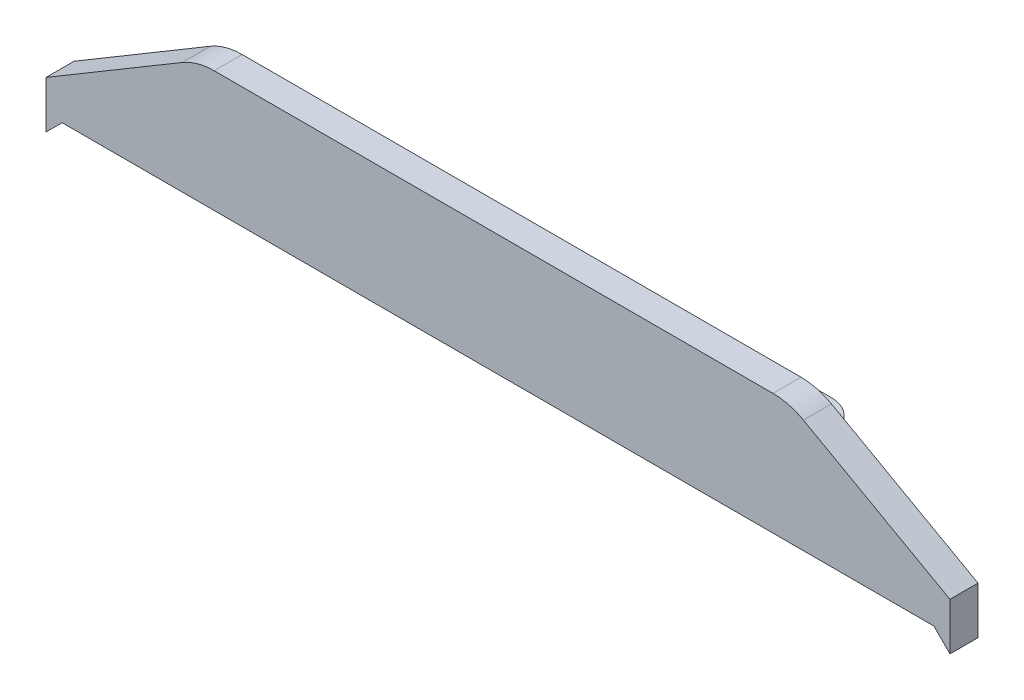
ISO-10303-21;
HEADER;
FILE_DESCRIPTION(('STEP AP214'),'2;1');
FILE_NAME('part.step','',(''),(''),'','','');
FILE_SCHEMA(('AUTOMOTIVE_DESIGN { 1 0 10303 214 1 1 1 1 }'));
ENDSEC;
DATA;
#1=APPLICATION_CONTEXT('core data for automotive mechanical design processes');
#2=APPLICATION_PROTOCOL_DEFINITION('international standard','automotive_design',2000,#1);
#3=PRODUCT_CONTEXT('',#1,'mechanical');
#4=PRODUCT('Part','Part','',(#3));
#5=PRODUCT_RELATED_PRODUCT_CATEGORY('part','',(#4));
#6=PRODUCT_DEFINITION_FORMATION('','',#4);
#7=PRODUCT_DEFINITION_CONTEXT('part definition',#1,'design');
#8=PRODUCT_DEFINITION('design','',#6,#7);
#9=PRODUCT_DEFINITION_SHAPE('','',#8);
#10=(LENGTH_UNIT() NAMED_UNIT(*) SI_UNIT(.MILLI.,.METRE.));
#11=(NAMED_UNIT(*) PLANE_ANGLE_UNIT() SI_UNIT($,.RADIAN.));
#12=(NAMED_UNIT(*) SI_UNIT($,.STERADIAN.) SOLID_ANGLE_UNIT());
#13=UNCERTAINTY_MEASURE_WITH_UNIT(LENGTH_MEASURE(1.E-05),#10,'distance_accuracy_value','');
#14=(GEOMETRIC_REPRESENTATION_CONTEXT(3) GLOBAL_UNCERTAINTY_ASSIGNED_CONTEXT((#13)) GLOBAL_UNIT_ASSIGNED_CONTEXT((#10,
#11,#12)) REPRESENTATION_CONTEXT('',''));
#15=CARTESIAN_POINT('',(0.,0.,0.));
#16=DIRECTION('',(0.,0.,1.));
#17=DIRECTION('',(1.,0.,0.));
#18=AXIS2_PLACEMENT_3D('',#15,#16,#17);
#19=CARTESIAN_POINT('',(0.,0.,0.));
#20=DIRECTION('',(0.,0.,1.));
#21=DIRECTION('',(1.,0.,0.));
#22=AXIS2_PLACEMENT_3D('',#19,#20,#21);
#23=PLANE('',#22);
#24=DIRECTION('',(-0.859315051902421,-0.511446616543643,0.));
#25=VECTOR('',#24,1.);
#26=CARTESIAN_POINT('',(22.3262838126983,-37.5118558080438,0.));
#27=LINE('',#26,#25);
#28=CARTESIAN_POINT('',(21.8545267075118,-37.7926359186027,0.));
#29=VERTEX_POINT('',#28);
#30=CARTESIAN_POINT('',(0.,-50.8,0.));
#31=VERTEX_POINT('',#30);
#32=EDGE_CURVE('E224',#29,#31,#27,.T.);
#33=ORIENTED_EDGE('',*,*,#32,.F.);
#34=CARTESIAN_POINT('',(26.9689928729482,-46.3857864376269,0.));
#35=DIRECTION('',(0.,0.,1.));
#36=DIRECTION('',(1.,0.,0.));
#37=AXIS2_PLACEMENT_3D('',#34,#35,#36);
#38=CIRCLE('',#37,10.);
#39=CARTESIAN_POINT('',(26.9689928729482,-36.3857864376269,0.));
#40=VERTEX_POINT('',#39);
#41=EDGE_CURVE('E259',#29,#40,#38,.F.);
#42=ORIENTED_EDGE('',*,*,#41,.T.);
#43=DIRECTION('',(-1.,0.,0.));
#44=VECTOR('',#43,1.);
#45=CARTESIAN_POINT('',(0.,-36.3857864376269,0.));
#46=LINE('',#45,#44);
#47=CARTESIAN_POINT('',(116.612627303235,-36.3857864376269,0.));
#48=VERTEX_POINT('',#47);
#49=EDGE_CURVE('E199',#48,#40,#46,.T.);
#50=ORIENTED_EDGE('',*,*,#49,.F.);
#51=CARTESIAN_POINT('',(116.612627303235,-46.3857864376269,0.));
#52=DIRECTION('',(0.,0.,1.));
#53=DIRECTION('',(1.,0.,0.));
#54=AXIS2_PLACEMENT_3D('',#51,#52,#53);
#55=CIRCLE('',#54,10.);
#56=CARTESIAN_POINT('',(121.492588511603,-37.6573284635727,0.));
#57=VERTEX_POINT('',#56);
#58=EDGE_CURVE('E257',#48,#57,#55,.F.);
#59=ORIENTED_EDGE('',*,*,#58,.T.);
#60=DIRECTION('',(-0.872845797405426,0.48799612083672,0.));
#61=VECTOR('',#60,1.);
#62=CARTESIAN_POINT('',(12.8923065712925,23.0596005360055,0.));
#63=LINE('',#62,#61);
#64=CARTESIAN_POINT('',(145.,-50.8,0.));
#65=VERTEX_POINT('',#64);
#66=EDGE_CURVE('E207',#65,#57,#63,.T.);
#67=ORIENTED_EDGE('',*,*,#66,.F.);
#68=DIRECTION('',(0.,1.,0.));
#69=VECTOR('',#68,1.);
#70=CARTESIAN_POINT('',(145.,0.,0.));
#71=LINE('',#70,#69);
#72=CARTESIAN_POINT('',(145.,-58.3857864376269,0.));
#73=VERTEX_POINT('',#72);
#74=EDGE_CURVE('E235',#73,#65,#71,.T.);
#75=ORIENTED_EDGE('',*,*,#74,.F.);
#76=DIRECTION('',(0.707106781186544,-0.707106781186551,0.));
#77=VECTOR('',#76,1.);
#78=CARTESIAN_POINT('',(43.3071067811873,43.3071067811868,0.));
#79=LINE('',#78,#77);
#80=CARTESIAN_POINT('',(142.414213562373,-55.8,0.));
#81=VERTEX_POINT('',#80);
#82=EDGE_CURVE('E233',#81,#73,#79,.T.);
#83=ORIENTED_EDGE('',*,*,#82,.F.);
#84=DIRECTION('',(1.,0.,0.));
#85=VECTOR('',#84,1.);
#86=CARTESIAN_POINT('',(0.,-55.8,0.));
#87=LINE('',#86,#85);
#88=CARTESIAN_POINT('',(2.58578643762691,-55.8,0.));
#89=VERTEX_POINT('',#88);
#90=EDGE_CURVE('E231',#89,#81,#87,.T.);
#91=ORIENTED_EDGE('',*,*,#90,.F.);
#92=DIRECTION('',(0.707106781186553,0.707106781186542,0.));
#93=VECTOR('',#92,1.);
#94=CARTESIAN_POINT('',(29.1928932188134,-29.1928932188139,0.));
#95=LINE('',#94,#93);
#96=CARTESIAN_POINT('',(0.,-58.3857864376269,0.));
#97=VERTEX_POINT('',#96);
#98=EDGE_CURVE('E229',#97,#89,#95,.T.);
#99=ORIENTED_EDGE('',*,*,#98,.F.);
#100=DIRECTION('',(0.,1.,0.));
#101=VECTOR('',#100,1.);
#102=CARTESIAN_POINT('',(0.,0.,0.));
#103=LINE('',#102,#101);
#104=EDGE_CURVE('E226',#97,#31,#103,.T.);
#105=ORIENTED_EDGE('',*,*,#104,.T.);
#106=EDGE_LOOP('',(#33,#42,#50,#59,#67,#75,#83,#91,#99,#105));
#107=FACE_BOUND('',#106,.T.);
#108=DIRECTION('',(1.,0.,0.));
#109=VECTOR('',#108,1.);
#110=CARTESIAN_POINT('',(21.4945597627013,-53.8,0.));
#111=LINE('',#110,#109);
#112=CARTESIAN_POINT('',(21.4945597627013,-53.8,0.));
#113=VERTEX_POINT('',#112);
#114=CARTESIAN_POINT('',(123.505440237299,-53.8,0.));
#115=VERTEX_POINT('',#114);
#116=EDGE_CURVE('E165',#113,#115,#111,.T.);
#117=ORIENTED_EDGE('',*,*,#116,.T.);
#118=DIRECTION('',(0.,-1.,0.));
#119=VECTOR('',#118,1.);
#120=CARTESIAN_POINT('',(123.505440237299,52.1677521857994,0.));
#121=LINE('',#120,#119);
#122=CARTESIAN_POINT('',(123.505440237299,-50.8,0.));
#123=VERTEX_POINT('',#122);
#124=EDGE_CURVE('E164',#123,#115,#121,.T.);
#125=ORIENTED_EDGE('',*,*,#124,.F.);
#126=DIRECTION('',(-1.,0.,0.));
#127=VECTOR('',#126,1.);
#128=CARTESIAN_POINT('',(21.4945597627013,-50.8,0.));
#129=LINE('',#128,#127);
#130=CARTESIAN_POINT('',(21.4945597627013,-50.8,0.));
#131=VERTEX_POINT('',#130);
#132=EDGE_CURVE('E161',#123,#131,#129,.T.);
#133=ORIENTED_EDGE('',*,*,#132,.T.);
#134=DIRECTION('',(0.,-1.,0.));
#135=VECTOR('',#134,1.);
#136=CARTESIAN_POINT('',(21.4945597627013,52.1677521857994,0.));
#137=LINE('',#136,#135);
#138=EDGE_CURVE('E600',#131,#113,#137,.T.);
#139=ORIENTED_EDGE('',*,*,#138,.T.);
#140=EDGE_LOOP('',(#117,#125,#133,#139));
#141=FACE_BOUND('',#140,.T.);
#142=ADVANCED_FACE('F39',(#107,#141),#23,.F.);
#143=CARTESIAN_POINT('',(0.,-36.3857864376269,4.5));
#144=DIRECTION('',(0.,-1.,0.));
#145=DIRECTION('',(0.,0.,-1.));
#146=AXIS2_PLACEMENT_3D('',#143,#144,#145);
#147=PLANE('',#146);
#148=ORIENTED_EDGE('',*,*,#49,.T.);
#149=DIRECTION('',(0.,0.,-1.));
#150=VECTOR('',#149,1.);
#151=CARTESIAN_POINT('',(26.9689928729482,-36.3857864376269,4.5));
#152=LINE('',#151,#150);
#153=CARTESIAN_POINT('',(26.9689928729482,-36.3857864376269,4.5));
#154=VERTEX_POINT('',#153);
#155=EDGE_CURVE('E60',#40,#154,#152,.F.);
#156=ORIENTED_EDGE('',*,*,#155,.T.);
#157=DIRECTION('',(-1.,0.,0.));
#158=VECTOR('',#157,1.);
#159=CARTESIAN_POINT('',(0.,-36.3857864376269,4.5));
#160=LINE('',#159,#158);
#161=CARTESIAN_POINT('',(116.612627303235,-36.3857864376269,4.5));
#162=VERTEX_POINT('',#161);
#163=EDGE_CURVE('E204',#162,#154,#160,.T.);
#164=ORIENTED_EDGE('',*,*,#163,.F.);
#165=DIRECTION('',(0.,0.,-1.));
#166=VECTOR('',#165,1.);
#167=CARTESIAN_POINT('',(116.612627303235,-36.3857864376269,4.5));
#168=LINE('',#167,#166);
#169=EDGE_CURVE('E261',#162,#48,#168,.T.);
#170=ORIENTED_EDGE('',*,*,#169,.T.);
#171=EDGE_LOOP('',(#148,#156,#164,#170));
#172=FACE_BOUND('',#171,.T.);
#173=ADVANCED_FACE('F281',(#172),#147,.F.);
#174=CARTESIAN_POINT('',(22.3262838126983,-37.5118558080438,4.5));
#175=DIRECTION('',(0.511446616543643,-0.859315051902421,0.));
#176=DIRECTION('',(0.859315051902421,0.511446616543643,0.));
#177=AXIS2_PLACEMENT_3D('',#174,#175,#176);
#178=PLANE('',#177);
#179=DIRECTION('',(-0.859315051902421,-0.511446616543643,0.));
#180=VECTOR('',#179,1.);
#181=CARTESIAN_POINT('',(22.3262838126983,-37.5118558080438,4.5));
#182=LINE('',#181,#180);
#183=CARTESIAN_POINT('',(21.8545267075118,-37.7926359186027,4.5));
#184=VERTEX_POINT('',#183);
#185=CARTESIAN_POINT('',(0.,-50.8,4.5));
#186=VERTEX_POINT('',#185);
#187=EDGE_CURVE('E206',#184,#186,#182,.T.);
#188=ORIENTED_EDGE('',*,*,#187,.F.);
#189=DIRECTION('',(0.,0.,-1.));
#190=VECTOR('',#189,1.);
#191=CARTESIAN_POINT('',(21.8545267075118,-37.7926359186027,4.5));
#192=LINE('',#191,#190);
#193=EDGE_CURVE('E254',#184,#29,#192,.T.);
#194=ORIENTED_EDGE('',*,*,#193,.T.);
#195=ORIENTED_EDGE('',*,*,#32,.T.);
#196=DIRECTION('',(0.,0.,-1.));
#197=VECTOR('',#196,1.);
#198=CARTESIAN_POINT('',(0.,-50.8,4.5));
#199=LINE('',#198,#197);
#200=EDGE_CURVE('E251',#186,#31,#199,.T.);
#201=ORIENTED_EDGE('',*,*,#200,.F.);
#202=EDGE_LOOP('',(#188,#194,#195,#201));
#203=FACE_BOUND('',#202,.T.);
#204=ADVANCED_FACE('F275',(#203),#178,.F.);
#205=CARTESIAN_POINT('',(0.,0.,4.5));
#206=DIRECTION('',(-1.,0.,0.));
#207=DIRECTION('',(0.,0.,1.));
#208=AXIS2_PLACEMENT_3D('',#205,#206,#207);
#209=PLANE('',#208);
#210=ORIENTED_EDGE('',*,*,#104,.F.);
#211=DIRECTION('',(0.,0.,-1.));
#212=VECTOR('',#211,1.);
#213=CARTESIAN_POINT('',(0.,-58.3857864376269,4.5));
#214=LINE('',#213,#212);
#215=CARTESIAN_POINT('',(0.,-58.3857864376269,4.5));
#216=VERTEX_POINT('',#215);
#217=EDGE_CURVE('E249',#216,#97,#214,.T.);
#218=ORIENTED_EDGE('',*,*,#217,.F.);
#219=DIRECTION('',(0.,1.,0.));
#220=VECTOR('',#219,1.);
#221=CARTESIAN_POINT('',(0.,0.,4.5));
#222=LINE('',#221,#220);
#223=EDGE_CURVE('E209',#216,#186,#222,.T.);
#224=ORIENTED_EDGE('',*,*,#223,.T.);
#225=ORIENTED_EDGE('',*,*,#200,.T.);
#226=EDGE_LOOP('',(#210,#218,#224,#225));
#227=FACE_BOUND('',#226,.T.);
#228=ADVANCED_FACE('F309',(#227),#209,.T.);
#229=CARTESIAN_POINT('',(29.1928932188134,-29.1928932188139,4.5));
#230=DIRECTION('',(-0.707106781186542,0.707106781186553,0.));
#231=DIRECTION('',(-0.707106781186553,-0.707106781186542,0.));
#232=AXIS2_PLACEMENT_3D('',#229,#230,#231);
#233=PLANE('',#232);
#234=ORIENTED_EDGE('',*,*,#98,.T.);
#235=DIRECTION('',(0.,0.,-1.));
#236=VECTOR('',#235,1.);
#237=CARTESIAN_POINT('',(2.58578643762691,-55.8,4.5));
#238=LINE('',#237,#236);
#239=CARTESIAN_POINT('',(2.58578643762691,-55.8,4.5));
#240=VERTEX_POINT('',#239);
#241=EDGE_CURVE('E246',#240,#89,#238,.T.);
#242=ORIENTED_EDGE('',*,*,#241,.F.);
#243=DIRECTION('',(0.707106781186553,0.707106781186542,0.));
#244=VECTOR('',#243,1.);
#245=CARTESIAN_POINT('',(29.1928932188134,-29.1928932188139,4.5));
#246=LINE('',#245,#244);
#247=EDGE_CURVE('E212',#216,#240,#246,.T.);
#248=ORIENTED_EDGE('',*,*,#247,.F.);
#249=ORIENTED_EDGE('',*,*,#217,.T.);
#250=EDGE_LOOP('',(#234,#242,#248,#249));
#251=FACE_BOUND('',#250,.T.);
#252=ADVANCED_FACE('F306',(#251),#233,.F.);
#253=CARTESIAN_POINT('',(0.,-55.8,4.5));
#254=DIRECTION('',(0.,1.,0.));
#255=DIRECTION('',(0.,0.,1.));
#256=AXIS2_PLACEMENT_3D('',#253,#254,#255);
#257=PLANE('',#256);
#258=ORIENTED_EDGE('',*,*,#90,.T.);
#259=DIRECTION('',(0.,0.,-1.));
#260=VECTOR('',#259,1.);
#261=CARTESIAN_POINT('',(142.414213562373,-55.8,4.5));
#262=LINE('',#261,#260);
#263=CARTESIAN_POINT('',(142.414213562373,-55.8,4.5));
#264=VERTEX_POINT('',#263);
#265=EDGE_CURVE('E243',#264,#81,#262,.T.);
#266=ORIENTED_EDGE('',*,*,#265,.F.);
#267=DIRECTION('',(1.,0.,0.));
#268=VECTOR('',#267,1.);
#269=CARTESIAN_POINT('',(0.,-55.8,4.5));
#270=LINE('',#269,#268);
#271=EDGE_CURVE('E214',#240,#264,#270,.T.);
#272=ORIENTED_EDGE('',*,*,#271,.F.);
#273=ORIENTED_EDGE('',*,*,#241,.T.);
#274=EDGE_LOOP('',(#258,#266,#272,#273));
#275=FACE_BOUND('',#274,.T.);
#276=ADVANCED_FACE('F302',(#275),#257,.F.);
#277=CARTESIAN_POINT('',(43.3071067811873,43.3071067811868,4.5));
#278=DIRECTION('',(0.707106781186551,0.707106781186544,0.));
#279=DIRECTION('',(-0.707106781186544,0.707106781186551,0.));
#280=AXIS2_PLACEMENT_3D('',#277,#278,#279);
#281=PLANE('',#280);
#282=ORIENTED_EDGE('',*,*,#82,.T.);
#283=DIRECTION('',(0.,0.,-1.));
#284=VECTOR('',#283,1.);
#285=CARTESIAN_POINT('',(145.,-58.3857864376269,4.5));
#286=LINE('',#285,#284);
#287=CARTESIAN_POINT('',(145.,-58.3857864376269,4.5));
#288=VERTEX_POINT('',#287);
#289=EDGE_CURVE('E240',#288,#73,#286,.T.);
#290=ORIENTED_EDGE('',*,*,#289,.F.);
#291=DIRECTION('',(0.707106781186544,-0.707106781186551,0.));
#292=VECTOR('',#291,1.);
#293=CARTESIAN_POINT('',(43.3071067811873,43.3071067811868,4.5));
#294=LINE('',#293,#292);
#295=EDGE_CURVE('E216',#264,#288,#294,.T.);
#296=ORIENTED_EDGE('',*,*,#295,.F.);
#297=ORIENTED_EDGE('',*,*,#265,.T.);
#298=EDGE_LOOP('',(#282,#290,#296,#297));
#299=FACE_BOUND('',#298,.T.);
#300=ADVANCED_FACE('F297',(#299),#281,.F.);
#301=CARTESIAN_POINT('',(145.,0.,4.5));
#302=DIRECTION('',(-1.,0.,0.));
#303=DIRECTION('',(0.,0.,1.));
#304=AXIS2_PLACEMENT_3D('',#301,#302,#303);
#305=PLANE('',#304);
#306=ORIENTED_EDGE('',*,*,#74,.T.);
#307=DIRECTION('',(0.,0.,-1.));
#308=VECTOR('',#307,1.);
#309=CARTESIAN_POINT('',(145.,-50.8,4.5));
#310=LINE('',#309,#308);
#311=CARTESIAN_POINT('',(145.,-50.8,4.5));
#312=VERTEX_POINT('',#311);
#313=EDGE_CURVE('E222',#312,#65,#310,.T.);
#314=ORIENTED_EDGE('',*,*,#313,.F.);
#315=DIRECTION('',(0.,1.,0.));
#316=VECTOR('',#315,1.);
#317=CARTESIAN_POINT('',(145.,0.,4.5));
#318=LINE('',#317,#316);
#319=EDGE_CURVE('E218',#288,#312,#318,.T.);
#320=ORIENTED_EDGE('',*,*,#319,.F.);
#321=ORIENTED_EDGE('',*,*,#289,.T.);
#322=EDGE_LOOP('',(#306,#314,#320,#321));
#323=FACE_BOUND('',#322,.T.);
#324=ADVANCED_FACE('F291',(#323),#305,.F.);
#325=CARTESIAN_POINT('',(12.8923065712925,23.0596005360055,4.5));
#326=DIRECTION('',(-0.48799612083672,-0.872845797405425,0.));
#327=DIRECTION('',(0.872845797405426,-0.48799612083672,0.));
#328=AXIS2_PLACEMENT_3D('',#325,#326,#327);
#329=PLANE('',#328);
#330=ORIENTED_EDGE('',*,*,#66,.T.);
#331=DIRECTION('',(0.,0.,-1.));
#332=VECTOR('',#331,1.);
#333=CARTESIAN_POINT('',(121.492588511603,-37.6573284635727,4.5));
#334=LINE('',#333,#332);
#335=CARTESIAN_POINT('',(121.492588511603,-37.6573284635727,4.5));
#336=VERTEX_POINT('',#335);
#337=EDGE_CURVE('E11',#57,#336,#334,.F.);
#338=ORIENTED_EDGE('',*,*,#337,.T.);
#339=DIRECTION('',(-0.872845797405426,0.48799612083672,0.));
#340=VECTOR('',#339,1.);
#341=CARTESIAN_POINT('',(12.8923065712925,23.0596005360055,4.5));
#342=LINE('',#341,#340);
#343=EDGE_CURVE('E220',#312,#336,#342,.T.);
#344=ORIENTED_EDGE('',*,*,#343,.F.);
#345=ORIENTED_EDGE('',*,*,#313,.T.);
#346=EDGE_LOOP('',(#330,#338,#344,#345));
#347=FACE_BOUND('',#346,.T.);
#348=ADVANCED_FACE('F287',(#347),#329,.F.);
#349=CARTESIAN_POINT('',(0.,0.,4.5));
#350=DIRECTION('',(0.,0.,1.));
#351=DIRECTION('',(1.,0.,0.));
#352=AXIS2_PLACEMENT_3D('',#349,#350,#351);
#353=PLANE('',#352);
#354=ORIENTED_EDGE('',*,*,#163,.T.);
#355=CARTESIAN_POINT('',(26.9689928729482,-46.3857864376269,4.5));
#356=DIRECTION('',(0.,0.,1.));
#357=DIRECTION('',(1.,0.,0.));
#358=AXIS2_PLACEMENT_3D('',#355,#356,#357);
#359=CIRCLE('',#358,10.);
#360=EDGE_CURVE('E47',#154,#184,#359,.T.);
#361=ORIENTED_EDGE('',*,*,#360,.T.);
#362=ORIENTED_EDGE('',*,*,#187,.T.);
#363=ORIENTED_EDGE('',*,*,#223,.F.);
#364=ORIENTED_EDGE('',*,*,#247,.T.);
#365=ORIENTED_EDGE('',*,*,#271,.T.);
#366=ORIENTED_EDGE('',*,*,#295,.T.);
#367=ORIENTED_EDGE('',*,*,#319,.T.);
#368=ORIENTED_EDGE('',*,*,#343,.T.);
#369=CARTESIAN_POINT('',(116.612627303235,-46.3857864376269,4.5));
#370=DIRECTION('',(0.,0.,1.));
#371=DIRECTION('',(1.,0.,0.));
#372=AXIS2_PLACEMENT_3D('',#369,#370,#371);
#373=CIRCLE('',#372,10.);
#374=EDGE_CURVE('E265',#336,#162,#373,.T.);
#375=ORIENTED_EDGE('',*,*,#374,.T.);
#376=EDGE_LOOP('',(#354,#361,#362,#363,#364,#365,#366,#367,#368,#375));
#377=FACE_BOUND('',#376,.T.);
#378=ADVANCED_FACE('F269',(#377),#353,.T.);
#379=CARTESIAN_POINT('',(107.512278329995,-53.8,-9.20493680791258));
#380=DIRECTION('',(0.,1.,0.));
#381=DIRECTION('',(0.,0.,1.));
#382=AXIS2_PLACEMENT_3D('',#379,#380,#381);
#383=PLANE('',#382);
#384=ORIENTED_EDGE('',*,*,#116,.F.);
#385=DIRECTION('',(-0.707106781186548,0.,0.707106781186547));
#386=VECTOR('',#385,1.);
#387=CARTESIAN_POINT('',(34.0936091203093,-53.8,-12.599049357608));
#388=LINE('',#387,#386);
#389=CARTESIAN_POINT('',(34.0936091203093,-53.8,-12.599049357608));
#390=VERTEX_POINT('',#389);
#391=EDGE_CURVE('E203',#390,#113,#388,.T.);
#392=ORIENTED_EDGE('',*,*,#391,.F.);
#393=CARTESIAN_POINT('',(37.4877216700047,-53.8,-9.20493680791258));
#394=DIRECTION('',(0.,1.,0.));
#395=DIRECTION('',(0.,0.,1.));
#396=AXIS2_PLACEMENT_3D('',#393,#394,#395);
#397=CIRCLE('',#396,4.79999999999999);
#398=CARTESIAN_POINT('',(37.4877216700048,-53.8,-14.0049368079126));
#399=VERTEX_POINT('',#398);
#400=EDGE_CURVE('E195',#399,#390,#397,.T.);
#401=ORIENTED_EDGE('',*,*,#400,.F.);
#402=DIRECTION('',(-1.,0.,0.));
#403=VECTOR('',#402,1.);
#404=CARTESIAN_POINT('',(107.512278329995,-53.8,-14.0049368079126));
#405=LINE('',#404,#403);
#406=CARTESIAN_POINT('',(107.512278329995,-53.8,-14.0049368079126));
#407=VERTEX_POINT('',#406);
#408=EDGE_CURVE('E190',#407,#399,#405,.T.);
#409=ORIENTED_EDGE('',*,*,#408,.F.);
#410=CARTESIAN_POINT('',(107.512278329995,-53.8,-9.20493680791258));
#411=DIRECTION('',(0.,1.,0.));
#412=DIRECTION('',(0.,0.,1.));
#413=AXIS2_PLACEMENT_3D('',#410,#411,#412);
#414=CIRCLE('',#413,4.79999999999998);
#415=CARTESIAN_POINT('',(110.906390879691,-53.8,-12.599049357608));
#416=VERTEX_POINT('',#415);
#417=EDGE_CURVE('E175',#416,#407,#414,.T.);
#418=ORIENTED_EDGE('',*,*,#417,.F.);
#419=DIRECTION('',(-0.707106781186547,0.,-0.707106781186548));
#420=VECTOR('',#419,1.);
#421=CARTESIAN_POINT('',(123.505440237299,-53.8,0.));
#422=LINE('',#421,#420);
#423=EDGE_CURVE('E171',#115,#416,#422,.T.);
#424=ORIENTED_EDGE('',*,*,#423,.F.);
#425=EDGE_LOOP('',(#384,#392,#401,#409,#418,#424));
#426=FACE_BOUND('',#425,.T.);
#427=CARTESIAN_POINT('',(37.4877216700047,-53.8,-9.20493680791258));
#428=DIRECTION('',(0.,1.,0.));
#429=DIRECTION('',(0.,0.,1.));
#430=AXIS2_PLACEMENT_3D('',#427,#428,#429);
#431=CIRCLE('',#430,1.65);
#432=CARTESIAN_POINT('',(37.4877216700047,-53.8,-7.55493680791258));
#433=VERTEX_POINT('',#432);
#434=EDGE_CURVE('E588',#433,#433,#431,.T.);
#435=ORIENTED_EDGE('',*,*,#434,.T.);
#436=EDGE_LOOP('',(#435));
#437=FACE_BOUND('',#436,.T.);
#438=CARTESIAN_POINT('',(107.512278329995,-53.8,-9.20493680791258));
#439=DIRECTION('',(0.,1.,0.));
#440=DIRECTION('',(0.,0.,1.));
#441=AXIS2_PLACEMENT_3D('',#438,#439,#440);
#442=CIRCLE('',#441,1.65);
#443=CARTESIAN_POINT('',(107.512278329995,-53.8,-7.55493680791258));
#444=VERTEX_POINT('',#443);
#445=EDGE_CURVE('E590',#444,#444,#442,.T.);
#446=ORIENTED_EDGE('',*,*,#445,.T.);
#447=EDGE_LOOP('',(#446));
#448=FACE_BOUND('',#447,.T.);
#449=ADVANCED_FACE('F358',(#426,#437,#448),#383,.F.);
#450=CARTESIAN_POINT('',(123.505440237299,52.1677521857994,0.));
#451=DIRECTION('',(-0.707106781186548,0.,0.707106781186547));
#452=DIRECTION('',(0.707106781186547,0.,0.707106781186548));
#453=AXIS2_PLACEMENT_3D('',#450,#451,#452);
#454=PLANE('',#453);
#455=DIRECTION('',(0.,-1.,0.));
#456=VECTOR('',#455,1.);
#457=CARTESIAN_POINT('',(110.906390879691,52.1677521857994,-12.599049357608));
#458=LINE('',#457,#456);
#459=CARTESIAN_POINT('',(110.906390879691,-50.8,-12.599049357608));
#460=VERTEX_POINT('',#459);
#461=EDGE_CURVE('E168',#460,#416,#458,.T.);
#462=ORIENTED_EDGE('',*,*,#461,.F.);
#463=DIRECTION('',(0.707106781186547,0.,0.707106781186548));
#464=VECTOR('',#463,1.);
#465=CARTESIAN_POINT('',(123.505440237299,-50.8,0.));
#466=LINE('',#465,#464);
#467=EDGE_CURVE('E154',#460,#123,#466,.T.);
#468=ORIENTED_EDGE('',*,*,#467,.T.);
#469=ORIENTED_EDGE('',*,*,#124,.T.);
#470=ORIENTED_EDGE('',*,*,#423,.T.);
#471=EDGE_LOOP('',(#462,#468,#469,#470));
#472=FACE_BOUND('',#471,.T.);
#473=ADVANCED_FACE('F169',(#472),#454,.F.);
#474=CARTESIAN_POINT('',(107.512278329995,52.1677521857994,-9.20493680791258));
#475=DIRECTION('',(0.,-1.,0.));
#476=DIRECTION('',(0.,0.,-1.));
#477=AXIS2_PLACEMENT_3D('',#474,#475,#476);
#478=CYLINDRICAL_SURFACE('',#477,4.79999999999998);
#479=DIRECTION('',(0.,-1.,0.));
#480=VECTOR('',#479,1.);
#481=CARTESIAN_POINT('',(107.512278329995,52.1677521857994,-14.0049368079126));
#482=LINE('',#481,#480);
#483=CARTESIAN_POINT('',(107.512278329995,-50.8,-14.0049368079126));
#484=VERTEX_POINT('',#483);
#485=EDGE_CURVE('E178',#484,#407,#482,.T.);
#486=ORIENTED_EDGE('',*,*,#485,.F.);
#487=CARTESIAN_POINT('',(107.512278329995,-50.8,-9.20493680791258));
#488=DIRECTION('',(0.,-1.,0.));
#489=DIRECTION('',(0.,0.,-1.));
#490=AXIS2_PLACEMENT_3D('',#487,#488,#489);
#491=CIRCLE('',#490,4.79999999999998);
#492=EDGE_CURVE('E158',#484,#460,#491,.T.);
#493=ORIENTED_EDGE('',*,*,#492,.T.);
#494=ORIENTED_EDGE('',*,*,#461,.T.);
#495=ORIENTED_EDGE('',*,*,#417,.T.);
#496=EDGE_LOOP('',(#486,#493,#494,#495));
#497=FACE_BOUND('',#496,.T.);
#498=ADVANCED_FACE('F177',(#497),#478,.T.);
#499=CARTESIAN_POINT('',(107.512278329995,52.1677521857994,-14.0049368079126));
#500=DIRECTION('',(0.,0.,1.));
#501=DIRECTION('',(1.,0.,0.));
#502=AXIS2_PLACEMENT_3D('',#499,#500,#501);
#503=PLANE('',#502);
#504=DIRECTION('',(0.,-1.,0.));
#505=VECTOR('',#504,1.);
#506=CARTESIAN_POINT('',(37.4877216700048,52.1677521857994,-14.0049368079126));
#507=LINE('',#506,#505);
#508=CARTESIAN_POINT('',(37.4877216700047,-50.8,-14.0049368079126));
#509=VERTEX_POINT('',#508);
#510=EDGE_CURVE('E189',#509,#399,#507,.T.);
#511=ORIENTED_EDGE('',*,*,#510,.F.);
#512=DIRECTION('',(1.,0.,0.));
#513=VECTOR('',#512,1.);
#514=CARTESIAN_POINT('',(107.512278329995,-50.8,-14.0049368079126));
#515=LINE('',#514,#513);
#516=EDGE_CURVE('E184',#509,#484,#515,.T.);
#517=ORIENTED_EDGE('',*,*,#516,.T.);
#518=ORIENTED_EDGE('',*,*,#485,.T.);
#519=ORIENTED_EDGE('',*,*,#408,.T.);
#520=EDGE_LOOP('',(#511,#517,#518,#519));
#521=FACE_BOUND('',#520,.T.);
#522=ADVANCED_FACE('F377',(#521),#503,.F.);
#523=CARTESIAN_POINT('',(37.4877216700047,52.1677521857994,-9.20493680791258));
#524=DIRECTION('',(0.,-1.,0.));
#525=DIRECTION('',(0.,0.,-1.));
#526=AXIS2_PLACEMENT_3D('',#523,#524,#525);
#527=CYLINDRICAL_SURFACE('',#526,4.79999999999999);
#528=DIRECTION('',(0.,-1.,0.));
#529=VECTOR('',#528,1.);
#530=CARTESIAN_POINT('',(34.0936091203093,52.1677521857994,-12.599049357608));
#531=LINE('',#530,#529);
#532=CARTESIAN_POINT('',(34.0936091203093,-50.8,-12.599049357608));
#533=VERTEX_POINT('',#532);
#534=EDGE_CURVE('E194',#533,#390,#531,.T.);
#535=ORIENTED_EDGE('',*,*,#534,.F.);
#536=CARTESIAN_POINT('',(37.4877216700047,-50.8,-9.20493680791258));
#537=DIRECTION('',(0.,-1.,0.));
#538=DIRECTION('',(0.,0.,-1.));
#539=AXIS2_PLACEMENT_3D('',#536,#537,#538);
#540=CIRCLE('',#539,4.79999999999999);
#541=EDGE_CURVE('E186',#533,#509,#540,.T.);
#542=ORIENTED_EDGE('',*,*,#541,.T.);
#543=ORIENTED_EDGE('',*,*,#510,.T.);
#544=ORIENTED_EDGE('',*,*,#400,.T.);
#545=EDGE_LOOP('',(#535,#542,#543,#544));
#546=FACE_BOUND('',#545,.T.);
#547=ADVANCED_FACE('F384',(#546),#527,.T.);
#548=CARTESIAN_POINT('',(34.0936091203093,52.1677521857994,-12.599049357608));
#549=DIRECTION('',(0.707106781186547,0.,0.707106781186548));
#550=DIRECTION('',(0.707106781186548,0.,-0.707106781186547));
#551=AXIS2_PLACEMENT_3D('',#548,#549,#550);
#552=PLANE('',#551);
#553=ORIENTED_EDGE('',*,*,#138,.F.);
#554=DIRECTION('',(0.707106781186548,0.,-0.707106781186547));
#555=VECTOR('',#554,1.);
#556=CARTESIAN_POINT('',(34.0936091203093,-50.8,-12.599049357608));
#557=LINE('',#556,#555);
#558=EDGE_CURVE('E191',#131,#533,#557,.T.);
#559=ORIENTED_EDGE('',*,*,#558,.T.);
#560=ORIENTED_EDGE('',*,*,#534,.T.);
#561=ORIENTED_EDGE('',*,*,#391,.T.);
#562=EDGE_LOOP('',(#553,#559,#560,#561));
#563=FACE_BOUND('',#562,.T.);
#564=ADVANCED_FACE('F392',(#563),#552,.F.);
#565=CARTESIAN_POINT('',(37.4877216700047,52.1677521857994,-9.20493680791258));
#566=DIRECTION('',(0.,-1.,0.));
#567=DIRECTION('',(0.,0.,-1.));
#568=AXIS2_PLACEMENT_3D('',#565,#566,#567);
#569=CYLINDRICAL_SURFACE('',#568,1.65);
#570=CARTESIAN_POINT('',(37.4877216700047,-50.8,-9.20493680791258));
#571=DIRECTION('',(0.,-1.,0.));
#572=DIRECTION('',(0.,0.,-1.));
#573=AXIS2_PLACEMENT_3D('',#570,#571,#572);
#574=CIRCLE('',#573,1.65);
#575=CARTESIAN_POINT('',(37.4877216700047,-50.8,-10.8549368079126));
#576=VERTEX_POINT('',#575);
#577=EDGE_CURVE('E196',#576,#576,#574,.T.);
#578=ORIENTED_EDGE('',*,*,#577,.F.);
#579=EDGE_LOOP('',(#578));
#580=FACE_BOUND('',#579,.T.);
#581=ORIENTED_EDGE('',*,*,#434,.F.);
#582=EDGE_LOOP('',(#581));
#583=FACE_BOUND('',#582,.T.);
#584=ADVANCED_FACE('F400',(#580,#583),#569,.F.);
#585=CARTESIAN_POINT('',(107.512278329995,52.1677521857994,-9.20493680791258));
#586=DIRECTION('',(0.,-1.,0.));
#587=DIRECTION('',(0.,0.,-1.));
#588=AXIS2_PLACEMENT_3D('',#585,#586,#587);
#589=CYLINDRICAL_SURFACE('',#588,1.65);
#590=CARTESIAN_POINT('',(107.512278329995,-50.8,-9.20493680791258));
#591=DIRECTION('',(0.,-1.,0.));
#592=DIRECTION('',(0.,0.,-1.));
#593=AXIS2_PLACEMENT_3D('',#590,#591,#592);
#594=CIRCLE('',#593,1.65);
#595=CARTESIAN_POINT('',(107.512278329995,-50.8,-10.8549368079126));
#596=VERTEX_POINT('',#595);
#597=EDGE_CURVE('E200',#596,#596,#594,.T.);
#598=ORIENTED_EDGE('',*,*,#597,.F.);
#599=EDGE_LOOP('',(#598));
#600=FACE_BOUND('',#599,.T.);
#601=ORIENTED_EDGE('',*,*,#445,.F.);
#602=EDGE_LOOP('',(#601));
#603=FACE_BOUND('',#602,.T.);
#604=ADVANCED_FACE('F408',(#600,#603),#589,.F.);
#605=CARTESIAN_POINT('',(0.,-50.8,-81.));
#606=DIRECTION('',(0.,-1.,0.));
#607=DIRECTION('',(1.,0.,0.));
#608=AXIS2_PLACEMENT_3D('',#605,#606,#607);
#609=PLANE('',#608);
#610=ORIENTED_EDGE('',*,*,#597,.T.);
#611=EDGE_LOOP('',(#610));
#612=FACE_BOUND('',#611,.T.);
#613=ORIENTED_EDGE('',*,*,#577,.T.);
#614=EDGE_LOOP('',(#613));
#615=FACE_BOUND('',#614,.T.);
#616=ORIENTED_EDGE('',*,*,#467,.F.);
#617=ORIENTED_EDGE('',*,*,#492,.F.);
#618=ORIENTED_EDGE('',*,*,#516,.F.);
#619=ORIENTED_EDGE('',*,*,#541,.F.);
#620=ORIENTED_EDGE('',*,*,#558,.F.);
#621=ORIENTED_EDGE('',*,*,#132,.F.);
#622=EDGE_LOOP('',(#616,#617,#618,#619,#620,#621));
#623=FACE_BOUND('',#622,.T.);
#624=ADVANCED_FACE('F156',(#612,#615,#623),#609,.F.);
#625=CARTESIAN_POINT('',(26.9689928729482,-46.3857864376269,4.5));
#626=DIRECTION('',(0.,0.,-1.));
#627=DIRECTION('',(-1.,0.,0.));
#628=AXIS2_PLACEMENT_3D('',#625,#626,#627);
#629=CYLINDRICAL_SURFACE('',#628,10.);
#630=ORIENTED_EDGE('',*,*,#360,.F.);
#631=ORIENTED_EDGE('',*,*,#155,.F.);
#632=ORIENTED_EDGE('',*,*,#41,.F.);
#633=ORIENTED_EDGE('',*,*,#193,.F.);
#634=EDGE_LOOP('',(#630,#631,#632,#633));
#635=FACE_BOUND('',#634,.T.);
#636=ADVANCED_FACE('F277',(#635),#629,.T.);
#637=CARTESIAN_POINT('',(116.612627303235,-46.3857864376269,4.5));
#638=DIRECTION('',(0.,0.,-1.));
#639=DIRECTION('',(-1.,0.,0.));
#640=AXIS2_PLACEMENT_3D('',#637,#638,#639);
#641=CYLINDRICAL_SURFACE('',#640,10.);
#642=ORIENTED_EDGE('',*,*,#374,.F.);
#643=ORIENTED_EDGE('',*,*,#337,.F.);
#644=ORIENTED_EDGE('',*,*,#58,.F.);
#645=ORIENTED_EDGE('',*,*,#169,.F.);
#646=EDGE_LOOP('',(#642,#643,#644,#645));
#647=FACE_BOUND('',#646,.T.);
#648=ADVANCED_FACE('F41',(#647),#641,.T.);
#649=CLOSED_SHELL('',(#142,#173,#204,#228,#252,#276,#300,#324,#348,#378,#449,#473,#498,#522,
#547,#564,#584,#604,#624,#636,#648));
#650=MANIFOLD_SOLID_BREP('B2',#649);
#651=ADVANCED_BREP_SHAPE_REPRESENTATION('',(#18,#650),#14);
#652=SHAPE_DEFINITION_REPRESENTATION(#9,#651);
ENDSEC;
END-ISO-10303-21;
